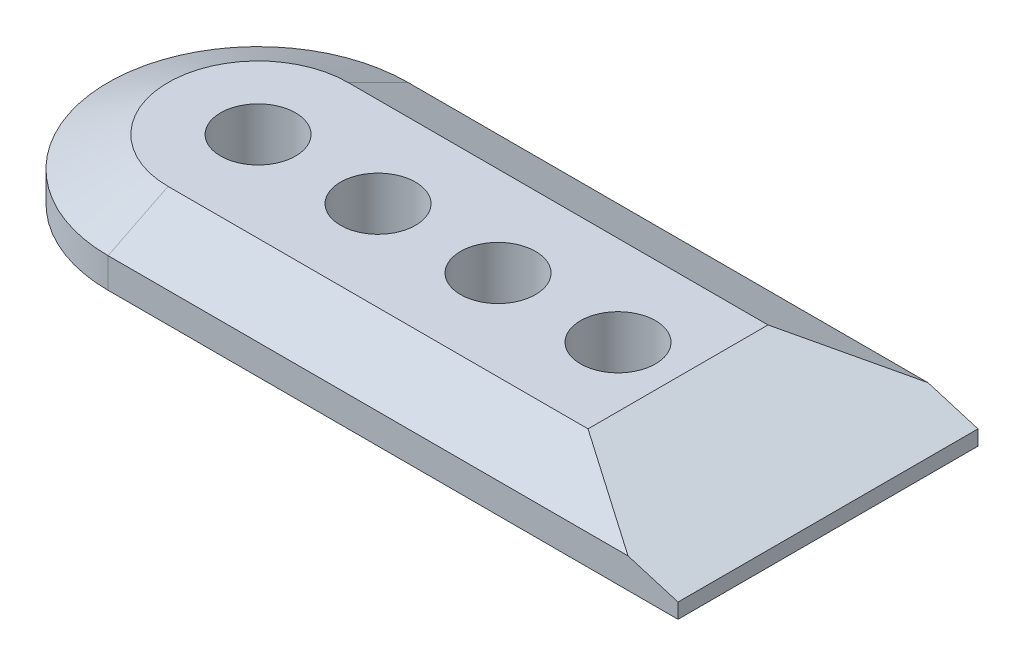
ISO-10303-21;
HEADER;
FILE_DESCRIPTION(('STEP AP214'),'2;1');
FILE_NAME('part.step','',(''),(''),'','','');
FILE_SCHEMA(('AUTOMOTIVE_DESIGN { 1 0 10303 214 1 1 1 1 }'));
ENDSEC;
DATA;
#1=APPLICATION_CONTEXT('core data for automotive mechanical design processes');
#2=APPLICATION_PROTOCOL_DEFINITION('international standard','automotive_design',2000,#1);
#3=PRODUCT_CONTEXT('',#1,'mechanical');
#4=PRODUCT('Part','Part','',(#3));
#5=PRODUCT_RELATED_PRODUCT_CATEGORY('part','',(#4));
#6=PRODUCT_DEFINITION_FORMATION('','',#4);
#7=PRODUCT_DEFINITION_CONTEXT('part definition',#1,'design');
#8=PRODUCT_DEFINITION('design','',#6,#7);
#9=PRODUCT_DEFINITION_SHAPE('','',#8);
#10=(LENGTH_UNIT() NAMED_UNIT(*) SI_UNIT(.MILLI.,.METRE.));
#11=(NAMED_UNIT(*) PLANE_ANGLE_UNIT() SI_UNIT($,.RADIAN.));
#12=(NAMED_UNIT(*) SI_UNIT($,.STERADIAN.) SOLID_ANGLE_UNIT());
#13=UNCERTAINTY_MEASURE_WITH_UNIT(LENGTH_MEASURE(1.E-05),#10,'distance_accuracy_value','');
#14=(GEOMETRIC_REPRESENTATION_CONTEXT(3) GLOBAL_UNCERTAINTY_ASSIGNED_CONTEXT((#13)) GLOBAL_UNIT_ASSIGNED_CONTEXT((#10,
#11,#12)) REPRESENTATION_CONTEXT('',''));
#15=CARTESIAN_POINT('',(0.,0.,0.));
#16=DIRECTION('',(0.,0.,1.));
#17=DIRECTION('',(1.,0.,0.));
#18=AXIS2_PLACEMENT_3D('',#15,#16,#17);
#19=CARTESIAN_POINT('',(0.,12.7,0.));
#20=DIRECTION('',(0.,-1.,0.));
#21=DIRECTION('',(0.,0.,-1.));
#22=AXIS2_PLACEMENT_3D('',#19,#20,#21);
#23=CYLINDRICAL_SURFACE('',#22,31.75);
#24=DIRECTION('',(0.,-1.,0.));
#25=VECTOR('',#24,1.);
#26=CARTESIAN_POINT('',(0.,12.7,31.75));
#27=LINE('',#26,#25);
#28=CARTESIAN_POINT('',(0.,6.34999999999998,31.75));
#29=VERTEX_POINT('',#28);
#30=CARTESIAN_POINT('',(0.,0.,31.75));
#31=VERTEX_POINT('',#30);
#32=EDGE_CURVE('E93',#29,#31,#27,.T.);
#33=ORIENTED_EDGE('',*,*,#32,.F.);
#34=CARTESIAN_POINT('',(0.,6.34999999999998,0.));
#35=DIRECTION('',(0.,1.,0.));
#36=DIRECTION('',(0.,0.,1.));
#37=AXIS2_PLACEMENT_3D('',#34,#35,#36);
#38=CIRCLE('',#37,31.75);
#39=CARTESIAN_POINT('',(0.,6.34999999999998,-31.75));
#40=VERTEX_POINT('',#39);
#41=EDGE_CURVE('E141',#29,#40,#38,.F.);
#42=ORIENTED_EDGE('',*,*,#41,.T.);
#43=DIRECTION('',(0.,-1.,0.));
#44=VECTOR('',#43,1.);
#45=CARTESIAN_POINT('',(0.,12.7,-31.75));
#46=LINE('',#45,#44);
#47=CARTESIAN_POINT('',(0.,0.,-31.75));
#48=VERTEX_POINT('',#47);
#49=EDGE_CURVE('E114',#40,#48,#46,.T.);
#50=ORIENTED_EDGE('',*,*,#49,.T.);
#51=CARTESIAN_POINT('',(0.,0.,0.));
#52=DIRECTION('',(0.,1.,0.));
#53=DIRECTION('',(0.,0.,1.));
#54=AXIS2_PLACEMENT_3D('',#51,#52,#53);
#55=CIRCLE('',#54,31.75);
#56=EDGE_CURVE('E109',#48,#31,#55,.T.);
#57=ORIENTED_EDGE('',*,*,#56,.T.);
#58=EDGE_LOOP('',(#33,#42,#50,#57));
#59=FACE_BOUND('',#58,.T.);
#60=ADVANCED_FACE('F35',(#59),#23,.T.);
#61=CARTESIAN_POINT('',(0.,12.7,31.75));
#62=DIRECTION('',(0.,0.,-1.));
#63=DIRECTION('',(-1.,0.,0.));
#64=AXIS2_PLACEMENT_3D('',#61,#62,#63);
#65=PLANE('',#64);
#66=DIRECTION('',(0.,-1.,0.));
#67=VECTOR('',#66,1.);
#68=CARTESIAN_POINT('',(120.65,12.7,31.75));
#69=LINE('',#68,#67);
#70=CARTESIAN_POINT('',(120.65,3.175,31.75));
#71=VERTEX_POINT('',#70);
#72=CARTESIAN_POINT('',(120.65,0.,31.75));
#73=VERTEX_POINT('',#72);
#74=EDGE_CURVE('E103',#71,#73,#69,.T.);
#75=ORIENTED_EDGE('',*,*,#74,.F.);
#76=DIRECTION('',(-0.957826285221152,0.287347885566343,0.));
#77=VECTOR('',#76,1.);
#78=CARTESIAN_POINT('',(88.8999999999997,12.7,31.75));
#79=LINE('',#78,#77);
#80=CARTESIAN_POINT('',(110.066666666667,6.34999999999998,31.75));
#81=VERTEX_POINT('',#80);
#82=EDGE_CURVE('E44',#71,#81,#79,.T.);
#83=ORIENTED_EDGE('',*,*,#82,.T.);
#84=DIRECTION('',(-1.,0.,0.));
#85=VECTOR('',#84,1.);
#86=CARTESIAN_POINT('',(0.,6.34999999999998,31.75));
#87=LINE('',#86,#85);
#88=EDGE_CURVE('E98',#81,#29,#87,.T.);
#89=ORIENTED_EDGE('',*,*,#88,.T.);
#90=ORIENTED_EDGE('',*,*,#32,.T.);
#91=DIRECTION('',(1.,0.,0.));
#92=VECTOR('',#91,1.);
#93=CARTESIAN_POINT('',(0.,0.,31.75));
#94=LINE('',#93,#92);
#95=EDGE_CURVE('E96',#31,#73,#94,.T.);
#96=ORIENTED_EDGE('',*,*,#95,.T.);
#97=EDGE_LOOP('',(#75,#83,#89,#90,#96));
#98=FACE_BOUND('',#97,.T.);
#99=ADVANCED_FACE('F95',(#98),#65,.F.);
#100=CARTESIAN_POINT('',(120.65,12.7,31.75));
#101=DIRECTION('',(-1.,0.,0.));
#102=DIRECTION('',(0.,0.,1.));
#103=AXIS2_PLACEMENT_3D('',#100,#101,#102);
#104=PLANE('',#103);
#105=DIRECTION('',(0.,-1.,0.));
#106=VECTOR('',#105,1.);
#107=CARTESIAN_POINT('',(120.65,12.7,-31.75));
#108=LINE('',#107,#106);
#109=CARTESIAN_POINT('',(120.65,3.175,-31.75));
#110=VERTEX_POINT('',#109);
#111=CARTESIAN_POINT('',(120.65,0.,-31.75));
#112=VERTEX_POINT('',#111);
#113=EDGE_CURVE('E129',#110,#112,#108,.T.);
#114=ORIENTED_EDGE('',*,*,#113,.F.);
#115=DIRECTION('',(0.,0.,1.));
#116=VECTOR('',#115,1.);
#117=CARTESIAN_POINT('',(120.65,3.175,19.0499999999999));
#118=LINE('',#117,#116);
#119=EDGE_CURVE('E58',#110,#71,#118,.T.);
#120=ORIENTED_EDGE('',*,*,#119,.T.);
#121=ORIENTED_EDGE('',*,*,#74,.T.);
#122=DIRECTION('',(0.,0.,-1.));
#123=VECTOR('',#122,1.);
#124=CARTESIAN_POINT('',(120.65,0.,31.75));
#125=LINE('',#124,#123);
#126=EDGE_CURVE('E111',#73,#112,#125,.T.);
#127=ORIENTED_EDGE('',*,*,#126,.T.);
#128=EDGE_LOOP('',(#114,#120,#121,#127));
#129=FACE_BOUND('',#128,.T.);
#130=ADVANCED_FACE('F159',(#129),#104,.F.);
#131=CARTESIAN_POINT('',(0.,12.7,-31.75));
#132=DIRECTION('',(0.,0.,1.));
#133=DIRECTION('',(1.,0.,0.));
#134=AXIS2_PLACEMENT_3D('',#131,#132,#133);
#135=PLANE('',#134);
#136=DIRECTION('',(1.,0.,0.));
#137=VECTOR('',#136,1.);
#138=CARTESIAN_POINT('',(120.65,6.34999999999998,-31.75));
#139=LINE('',#138,#137);
#140=CARTESIAN_POINT('',(110.066666666667,6.34999999999998,-31.75));
#141=VERTEX_POINT('',#140);
#142=EDGE_CURVE('E138',#40,#141,#139,.T.);
#143=ORIENTED_EDGE('',*,*,#142,.T.);
#144=DIRECTION('',(0.957826285221152,-0.287347885566343,0.));
#145=VECTOR('',#144,1.);
#146=CARTESIAN_POINT('',(88.8999999999997,12.7,-31.75));
#147=LINE('',#146,#145);
#148=EDGE_CURVE('E152',#141,#110,#147,.T.);
#149=ORIENTED_EDGE('',*,*,#148,.T.);
#150=ORIENTED_EDGE('',*,*,#113,.T.);
#151=DIRECTION('',(-1.,0.,0.));
#152=VECTOR('',#151,1.);
#153=CARTESIAN_POINT('',(0.,0.,-31.75));
#154=LINE('',#153,#152);
#155=EDGE_CURVE('E126',#112,#48,#154,.T.);
#156=ORIENTED_EDGE('',*,*,#155,.T.);
#157=ORIENTED_EDGE('',*,*,#49,.F.);
#158=EDGE_LOOP('',(#143,#149,#150,#156,#157));
#159=FACE_BOUND('',#158,.T.);
#160=ADVANCED_FACE('F156',(#159),#135,.F.);
#161=CARTESIAN_POINT('',(0.,12.7,0.));
#162=DIRECTION('',(0.,1.,0.));
#163=DIRECTION('',(0.,0.,1.));
#164=AXIS2_PLACEMENT_3D('',#161,#162,#163);
#165=PLANE('',#164);
#166=CARTESIAN_POINT('',(0.,12.7,0.));
#167=DIRECTION('',(0.,1.,0.));
#168=DIRECTION('',(0.,0.,1.));
#169=AXIS2_PLACEMENT_3D('',#166,#167,#168);
#170=CIRCLE('',#169,7.9375);
#171=CARTESIAN_POINT('',(0.,12.7,7.9375));
#172=VERTEX_POINT('',#171);
#173=EDGE_CURVE('E222',#172,#172,#170,.T.);
#174=ORIENTED_EDGE('',*,*,#173,.F.);
#175=EDGE_LOOP('',(#174));
#176=FACE_BOUND('',#175,.T.);
#177=CARTESIAN_POINT('',(50.8,12.7,0.));
#178=DIRECTION('',(0.,1.,0.));
#179=DIRECTION('',(0.,0.,1.));
#180=AXIS2_PLACEMENT_3D('',#177,#178,#179);
#181=CIRCLE('',#180,7.9375);
#182=CARTESIAN_POINT('',(50.8,12.7,7.9375));
#183=VERTEX_POINT('',#182);
#184=EDGE_CURVE('E230',#183,#183,#181,.T.);
#185=ORIENTED_EDGE('',*,*,#184,.F.);
#186=EDGE_LOOP('',(#185));
#187=FACE_BOUND('',#186,.T.);
#188=CARTESIAN_POINT('',(76.2,12.7,0.));
#189=DIRECTION('',(0.,1.,0.));
#190=DIRECTION('',(0.,0.,1.));
#191=AXIS2_PLACEMENT_3D('',#188,#189,#190);
#192=CIRCLE('',#191,7.93749999999999);
#193=CARTESIAN_POINT('',(76.2,12.7,7.93749999999999));
#194=VERTEX_POINT('',#193);
#195=EDGE_CURVE('E237',#194,#194,#192,.T.);
#196=ORIENTED_EDGE('',*,*,#195,.F.);
#197=EDGE_LOOP('',(#196));
#198=FACE_BOUND('',#197,.T.);
#199=CARTESIAN_POINT('',(25.4,12.7,0.));
#200=DIRECTION('',(0.,1.,0.));
#201=DIRECTION('',(0.,0.,1.));
#202=AXIS2_PLACEMENT_3D('',#199,#200,#201);
#203=CIRCLE('',#202,7.9375);
#204=CARTESIAN_POINT('',(25.4,12.7,7.9375));
#205=VERTEX_POINT('',#204);
#206=EDGE_CURVE('E223',#205,#205,#203,.T.);
#207=ORIENTED_EDGE('',*,*,#206,.F.);
#208=EDGE_LOOP('',(#207));
#209=FACE_BOUND('',#208,.T.);
#210=DIRECTION('',(1.,0.,0.));
#211=VECTOR('',#210,1.);
#212=CARTESIAN_POINT('',(120.65,12.7,19.0499999999999));
#213=LINE('',#212,#211);
#214=CARTESIAN_POINT('',(0.,12.7,19.0499999999999));
#215=VERTEX_POINT('',#214);
#216=CARTESIAN_POINT('',(88.8999999999997,12.7,19.0499999999999));
#217=VERTEX_POINT('',#216);
#218=EDGE_CURVE('E102',#215,#217,#213,.T.);
#219=ORIENTED_EDGE('',*,*,#218,.T.);
#220=DIRECTION('',(0.,0.,-1.));
#221=VECTOR('',#220,1.);
#222=CARTESIAN_POINT('',(88.8999999999997,12.7,-19.0499999999999));
#223=LINE('',#222,#221);
#224=CARTESIAN_POINT('',(88.8999999999997,12.7,-19.0499999999999));
#225=VERTEX_POINT('',#224);
#226=EDGE_CURVE('E144',#217,#225,#223,.T.);
#227=ORIENTED_EDGE('',*,*,#226,.T.);
#228=DIRECTION('',(-1.,0.,0.));
#229=VECTOR('',#228,1.);
#230=CARTESIAN_POINT('',(0.,12.7,-19.0499999999999));
#231=LINE('',#230,#229);
#232=CARTESIAN_POINT('',(0.,12.7,-19.0499999999999));
#233=VERTEX_POINT('',#232);
#234=EDGE_CURVE('E136',#225,#233,#231,.T.);
#235=ORIENTED_EDGE('',*,*,#234,.T.);
#236=CARTESIAN_POINT('',(0.,12.7,0.));
#237=DIRECTION('',(0.,1.,0.));
#238=DIRECTION('',(0.,0.,1.));
#239=AXIS2_PLACEMENT_3D('',#236,#237,#238);
#240=CIRCLE('',#239,19.0499999999999);
#241=EDGE_CURVE('E134',#233,#215,#240,.T.);
#242=ORIENTED_EDGE('',*,*,#241,.T.);
#243=EDGE_LOOP('',(#219,#227,#235,#242));
#244=FACE_BOUND('',#243,.T.);
#245=ADVANCED_FACE('F166',(#176,#187,#198,#209,#244),#165,.T.);
#246=CARTESIAN_POINT('',(0.,0.,0.));
#247=DIRECTION('',(0.,1.,0.));
#248=DIRECTION('',(0.,0.,1.));
#249=AXIS2_PLACEMENT_3D('',#246,#247,#248);
#250=PLANE('',#249);
#251=CARTESIAN_POINT('',(0.,0.,0.));
#252=DIRECTION('',(0.,1.,0.));
#253=DIRECTION('',(0.,0.,1.));
#254=AXIS2_PLACEMENT_3D('',#251,#252,#253);
#255=CIRCLE('',#254,7.9375);
#256=CARTESIAN_POINT('',(0.,0.,7.9375));
#257=VERTEX_POINT('',#256);
#258=EDGE_CURVE('E146',#257,#257,#255,.T.);
#259=ORIENTED_EDGE('',*,*,#258,.T.);
#260=EDGE_LOOP('',(#259));
#261=FACE_BOUND('',#260,.T.);
#262=CARTESIAN_POINT('',(50.8,0.,0.));
#263=DIRECTION('',(0.,1.,0.));
#264=DIRECTION('',(0.,0.,1.));
#265=AXIS2_PLACEMENT_3D('',#262,#263,#264);
#266=CIRCLE('',#265,7.9375);
#267=CARTESIAN_POINT('',(50.8,0.,7.9375));
#268=VERTEX_POINT('',#267);
#269=EDGE_CURVE('E233',#268,#268,#266,.T.);
#270=ORIENTED_EDGE('',*,*,#269,.T.);
#271=EDGE_LOOP('',(#270));
#272=FACE_BOUND('',#271,.T.);
#273=CARTESIAN_POINT('',(76.2,0.,0.));
#274=DIRECTION('',(0.,1.,0.));
#275=DIRECTION('',(0.,0.,1.));
#276=AXIS2_PLACEMENT_3D('',#273,#274,#275);
#277=CIRCLE('',#276,7.93749999999999);
#278=CARTESIAN_POINT('',(76.2,0.,7.93749999999999));
#279=VERTEX_POINT('',#278);
#280=EDGE_CURVE('E122',#279,#279,#277,.T.);
#281=ORIENTED_EDGE('',*,*,#280,.T.);
#282=EDGE_LOOP('',(#281));
#283=FACE_BOUND('',#282,.T.);
#284=CARTESIAN_POINT('',(25.4,0.,0.));
#285=DIRECTION('',(0.,1.,0.));
#286=DIRECTION('',(0.,0.,1.));
#287=AXIS2_PLACEMENT_3D('',#284,#285,#286);
#288=CIRCLE('',#287,7.9375);
#289=CARTESIAN_POINT('',(25.4,0.,7.9375));
#290=VERTEX_POINT('',#289);
#291=EDGE_CURVE('E227',#290,#290,#288,.T.);
#292=ORIENTED_EDGE('',*,*,#291,.T.);
#293=EDGE_LOOP('',(#292));
#294=FACE_BOUND('',#293,.T.);
#295=ORIENTED_EDGE('',*,*,#56,.F.);
#296=ORIENTED_EDGE('',*,*,#155,.F.);
#297=ORIENTED_EDGE('',*,*,#126,.F.);
#298=ORIENTED_EDGE('',*,*,#95,.F.);
#299=EDGE_LOOP('',(#295,#296,#297,#298));
#300=FACE_BOUND('',#299,.T.);
#301=ADVANCED_FACE('F107',(#261,#272,#283,#294,#300),#250,.F.);
#302=CARTESIAN_POINT('',(0.,12.7,19.0499999999999));
#303=DIRECTION('',(0.,0.894427190999917,0.447213595499956));
#304=DIRECTION('',(-1.,0.,0.));
#305=AXIS2_PLACEMENT_3D('',#302,#303,#304);
#306=PLANE('',#305);
#307=ORIENTED_EDGE('',*,*,#88,.F.);
#308=DIRECTION('',(-0.830454798537401,0.249136439561218,-0.498272879122438));
#309=VECTOR('',#308,1.);
#310=CARTESIAN_POINT('',(27.5896551724134,31.0931034482757,-17.7362068965516));
#311=LINE('',#310,#309);
#312=EDGE_CURVE('E11',#81,#217,#311,.T.);
#313=ORIENTED_EDGE('',*,*,#312,.T.);
#314=ORIENTED_EDGE('',*,*,#218,.F.);
#315=DIRECTION('',(0.,0.447213595499956,-0.894427190999917));
#316=VECTOR('',#315,1.);
#317=CARTESIAN_POINT('',(0.,6.34999999999998,31.75));
#318=LINE('',#317,#316);
#319=EDGE_CURVE('E116',#29,#215,#318,.T.);
#320=ORIENTED_EDGE('',*,*,#319,.F.);
#321=EDGE_LOOP('',(#307,#313,#314,#320));
#322=FACE_BOUND('',#321,.T.);
#323=ADVANCED_FACE('F164',(#322),#306,.T.);
#324=CARTESIAN_POINT('',(0.,12.7,0.));
#325=DIRECTION('',(0.,-1.,0.));
#326=DIRECTION('',(0.,0.,-1.));
#327=AXIS2_PLACEMENT_3D('',#324,#325,#326);
#328=CONICAL_SURFACE('',#327,19.0499999999999,1.10714871779409);
#329=ORIENTED_EDGE('',*,*,#319,.T.);
#330=ORIENTED_EDGE('',*,*,#241,.F.);
#331=DIRECTION('',(0.,0.447213595499956,0.894427190999917));
#332=VECTOR('',#331,1.);
#333=CARTESIAN_POINT('',(0.,6.34999999999998,-31.75));
#334=LINE('',#333,#332);
#335=EDGE_CURVE('E119',#40,#233,#334,.T.);
#336=ORIENTED_EDGE('',*,*,#335,.F.);
#337=ORIENTED_EDGE('',*,*,#41,.F.);
#338=EDGE_LOOP('',(#329,#330,#336,#337));
#339=FACE_BOUND('',#338,.T.);
#340=ADVANCED_FACE('F171',(#339),#328,.T.);
#341=CARTESIAN_POINT('',(0.,12.7,-19.0499999999999));
#342=DIRECTION('',(0.,0.894427190999917,-0.447213595499956));
#343=DIRECTION('',(1.,0.,0.));
#344=AXIS2_PLACEMENT_3D('',#341,#342,#343);
#345=PLANE('',#344);
#346=ORIENTED_EDGE('',*,*,#234,.F.);
#347=DIRECTION('',(0.830454798537401,-0.249136439561218,-0.498272879122438));
#348=VECTOR('',#347,1.);
#349=CARTESIAN_POINT('',(27.5896551724134,31.0931034482757,17.7362068965516));
#350=LINE('',#349,#348);
#351=EDGE_CURVE('E150',#225,#141,#350,.T.);
#352=ORIENTED_EDGE('',*,*,#351,.T.);
#353=ORIENTED_EDGE('',*,*,#142,.F.);
#354=ORIENTED_EDGE('',*,*,#335,.T.);
#355=EDGE_LOOP('',(#346,#352,#353,#354));
#356=FACE_BOUND('',#355,.T.);
#357=ADVANCED_FACE('F174',(#356),#345,.T.);
#358=CARTESIAN_POINT('',(88.8999999999997,12.7,0.));
#359=DIRECTION('',(0.287347885566343,0.957826285221152,0.));
#360=DIRECTION('',(0.,0.,1.));
#361=AXIS2_PLACEMENT_3D('',#358,#359,#360);
#362=PLANE('',#361);
#363=ORIENTED_EDGE('',*,*,#82,.F.);
#364=ORIENTED_EDGE('',*,*,#119,.F.);
#365=ORIENTED_EDGE('',*,*,#148,.F.);
#366=ORIENTED_EDGE('',*,*,#351,.F.);
#367=ORIENTED_EDGE('',*,*,#226,.F.);
#368=ORIENTED_EDGE('',*,*,#312,.F.);
#369=EDGE_LOOP('',(#363,#364,#365,#366,#367,#368));
#370=FACE_BOUND('',#369,.T.);
#371=ADVANCED_FACE('F38',(#370),#362,.T.);
#372=CARTESIAN_POINT('',(25.4,0.,0.));
#373=DIRECTION('',(0.,1.,0.));
#374=DIRECTION('',(0.,0.,1.));
#375=AXIS2_PLACEMENT_3D('',#372,#373,#374);
#376=CYLINDRICAL_SURFACE('',#375,7.9375);
#377=ORIENTED_EDGE('',*,*,#291,.F.);
#378=EDGE_LOOP('',(#377));
#379=FACE_BOUND('',#378,.T.);
#380=ORIENTED_EDGE('',*,*,#206,.T.);
#381=EDGE_LOOP('',(#380));
#382=FACE_BOUND('',#381,.T.);
#383=ADVANCED_FACE('F181',(#379,#382),#376,.F.);
#384=CARTESIAN_POINT('',(76.2,0.,0.));
#385=DIRECTION('',(0.,1.,0.));
#386=DIRECTION('',(0.,0.,1.));
#387=AXIS2_PLACEMENT_3D('',#384,#385,#386);
#388=CYLINDRICAL_SURFACE('',#387,7.93749999999999);
#389=ORIENTED_EDGE('',*,*,#280,.F.);
#390=EDGE_LOOP('',(#389));
#391=FACE_BOUND('',#390,.T.);
#392=ORIENTED_EDGE('',*,*,#195,.T.);
#393=EDGE_LOOP('',(#392));
#394=FACE_BOUND('',#393,.T.);
#395=ADVANCED_FACE('F201',(#391,#394),#388,.F.);
#396=CARTESIAN_POINT('',(50.8,0.,0.));
#397=DIRECTION('',(0.,1.,0.));
#398=DIRECTION('',(0.,0.,1.));
#399=AXIS2_PLACEMENT_3D('',#396,#397,#398);
#400=CYLINDRICAL_SURFACE('',#399,7.9375);
#401=ORIENTED_EDGE('',*,*,#269,.F.);
#402=EDGE_LOOP('',(#401));
#403=FACE_BOUND('',#402,.T.);
#404=ORIENTED_EDGE('',*,*,#184,.T.);
#405=EDGE_LOOP('',(#404));
#406=FACE_BOUND('',#405,.T.);
#407=ADVANCED_FACE('F204',(#403,#406),#400,.F.);
#408=CARTESIAN_POINT('',(0.,0.,0.));
#409=DIRECTION('',(0.,1.,0.));
#410=DIRECTION('',(0.,0.,1.));
#411=AXIS2_PLACEMENT_3D('',#408,#409,#410);
#412=CYLINDRICAL_SURFACE('',#411,7.9375);
#413=ORIENTED_EDGE('',*,*,#258,.F.);
#414=EDGE_LOOP('',(#413));
#415=FACE_BOUND('',#414,.T.);
#416=ORIENTED_EDGE('',*,*,#173,.T.);
#417=EDGE_LOOP('',(#416));
#418=FACE_BOUND('',#417,.T.);
#419=ADVANCED_FACE('F211',(#415,#418),#412,.F.);
#420=CLOSED_SHELL('',(#60,#99,#130,#160,#245,#301,#323,#340,#357,#371,#383,#395,#407,#419));
#421=MANIFOLD_SOLID_BREP('B2',#420);
#422=ADVANCED_BREP_SHAPE_REPRESENTATION('',(#18,#421),#14);
#423=SHAPE_DEFINITION_REPRESENTATION(#9,#422);
ENDSEC;
END-ISO-10303-21;
